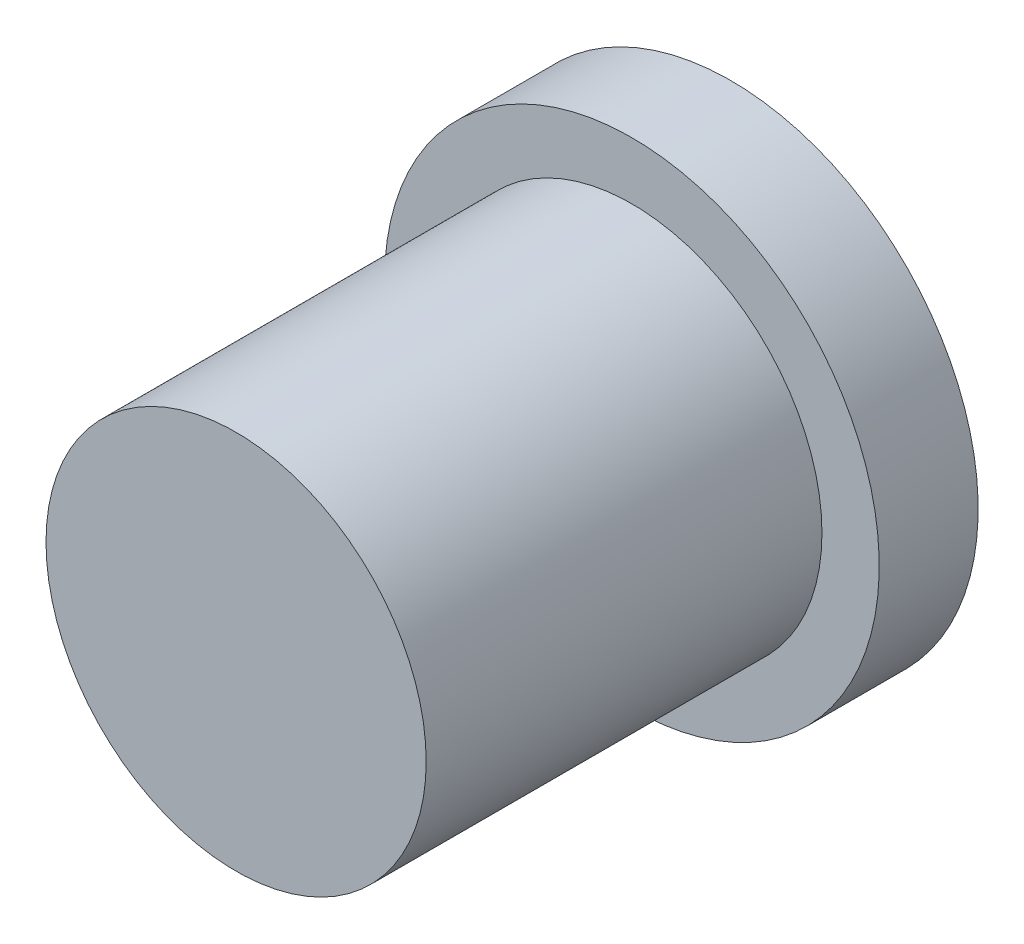
ISO-10303-21;
HEADER;
FILE_DESCRIPTION(('STEP AP214'),'2;1');
FILE_NAME('part.step','',(''),(''),'','','');
FILE_SCHEMA(('AUTOMOTIVE_DESIGN { 1 0 10303 214 1 1 1 1 }'));
ENDSEC;
DATA;
#1=APPLICATION_CONTEXT('core data for automotive mechanical design processes');
#2=APPLICATION_PROTOCOL_DEFINITION('international standard','automotive_design',2000,#1);
#3=PRODUCT_CONTEXT('',#1,'mechanical');
#4=PRODUCT('Part','Part','',(#3));
#5=PRODUCT_RELATED_PRODUCT_CATEGORY('part','',(#4));
#6=PRODUCT_DEFINITION_FORMATION('','',#4);
#7=PRODUCT_DEFINITION_CONTEXT('part definition',#1,'design');
#8=PRODUCT_DEFINITION('design','',#6,#7);
#9=PRODUCT_DEFINITION_SHAPE('','',#8);
#10=(LENGTH_UNIT() NAMED_UNIT(*) SI_UNIT(.MILLI.,.METRE.));
#11=(NAMED_UNIT(*) PLANE_ANGLE_UNIT() SI_UNIT($,.RADIAN.));
#12=(NAMED_UNIT(*) SI_UNIT($,.STERADIAN.) SOLID_ANGLE_UNIT());
#13=UNCERTAINTY_MEASURE_WITH_UNIT(LENGTH_MEASURE(1.E-05),#10,'distance_accuracy_value','');
#14=(GEOMETRIC_REPRESENTATION_CONTEXT(3) GLOBAL_UNCERTAINTY_ASSIGNED_CONTEXT((#13)) GLOBAL_UNIT_ASSIGNED_CONTEXT((#10,
#11,#12)) REPRESENTATION_CONTEXT('',''));
#15=CARTESIAN_POINT('',(0.,0.,0.));
#16=DIRECTION('',(0.,0.,1.));
#17=DIRECTION('',(1.,0.,0.));
#18=AXIS2_PLACEMENT_3D('',#15,#16,#17);
#19=CARTESIAN_POINT('',(0.,0.,12.7));
#20=DIRECTION('',(0.,0.,-1.));
#21=DIRECTION('',(-1.,0.,0.));
#22=AXIS2_PLACEMENT_3D('',#19,#20,#21);
#23=CYLINDRICAL_SURFACE('',#22,6.1);
#24=CARTESIAN_POINT('',(0.,0.,12.7));
#25=DIRECTION('',(0.,0.,1.));
#26=DIRECTION('',(1.,0.,0.));
#27=AXIS2_PLACEMENT_3D('',#24,#25,#26);
#28=CIRCLE('',#27,6.1);
#29=CARTESIAN_POINT('',(6.1,0.,12.7));
#30=VERTEX_POINT('',#29);
#31=EDGE_CURVE('E11',#30,#30,#28,.T.);
#32=ORIENTED_EDGE('',*,*,#31,.F.);
#33=EDGE_LOOP('',(#32));
#34=FACE_BOUND('',#33,.T.);
#35=CARTESIAN_POINT('',(0.,0.,0.));
#36=DIRECTION('',(0.,0.,-1.));
#37=DIRECTION('',(-1.,0.,0.));
#38=AXIS2_PLACEMENT_3D('',#35,#36,#37);
#39=CIRCLE('',#38,6.1);
#40=CARTESIAN_POINT('',(-6.1,0.,0.));
#41=VERTEX_POINT('',#40);
#42=EDGE_CURVE('E40',#41,#41,#39,.F.);
#43=ORIENTED_EDGE('',*,*,#42,.T.);
#44=EDGE_LOOP('',(#43));
#45=FACE_BOUND('',#44,.T.);
#46=ADVANCED_FACE('F37',(#34,#45),#23,.T.);
#47=CARTESIAN_POINT('',(0.,0.,12.7));
#48=DIRECTION('',(0.,0.,1.));
#49=DIRECTION('',(1.,0.,0.));
#50=AXIS2_PLACEMENT_3D('',#47,#48,#49);
#51=PLANE('',#50);
#52=ORIENTED_EDGE('',*,*,#31,.T.);
#53=EDGE_LOOP('',(#52));
#54=FACE_BOUND('',#53,.T.);
#55=ADVANCED_FACE('F64',(#54),#51,.T.);
#56=CARTESIAN_POINT('',(0.,0.,-3.175));
#57=DIRECTION('',(0.,0.,1.));
#58=DIRECTION('',(1.,0.,0.));
#59=AXIS2_PLACEMENT_3D('',#56,#57,#58);
#60=CYLINDRICAL_SURFACE('',#59,7.9375);
#61=CARTESIAN_POINT('',(0.,0.,-3.175));
#62=DIRECTION('',(0.,0.,-1.));
#63=DIRECTION('',(-1.,0.,0.));
#64=AXIS2_PLACEMENT_3D('',#61,#62,#63);
#65=CIRCLE('',#64,7.9375);
#66=CARTESIAN_POINT('',(-7.9375,0.,-3.175));
#67=VERTEX_POINT('',#66);
#68=EDGE_CURVE('E49',#67,#67,#65,.T.);
#69=ORIENTED_EDGE('',*,*,#68,.F.);
#70=EDGE_LOOP('',(#69));
#71=FACE_BOUND('',#70,.T.);
#72=CARTESIAN_POINT('',(0.,0.,0.));
#73=DIRECTION('',(0.,0.,-1.));
#74=DIRECTION('',(-1.,0.,0.));
#75=AXIS2_PLACEMENT_3D('',#72,#73,#74);
#76=CIRCLE('',#75,7.9375);
#77=CARTESIAN_POINT('',(-7.9375,0.,0.));
#78=VERTEX_POINT('',#77);
#79=EDGE_CURVE('E51',#78,#78,#76,.T.);
#80=ORIENTED_EDGE('',*,*,#79,.T.);
#81=EDGE_LOOP('',(#80));
#82=FACE_BOUND('',#81,.T.);
#83=ADVANCED_FACE('F61',(#71,#82),#60,.T.);
#84=CARTESIAN_POINT('',(0.,0.,-3.175));
#85=DIRECTION('',(0.,0.,-1.));
#86=DIRECTION('',(-1.,0.,0.));
#87=AXIS2_PLACEMENT_3D('',#84,#85,#86);
#88=PLANE('',#87);
#89=ORIENTED_EDGE('',*,*,#68,.T.);
#90=EDGE_LOOP('',(#89));
#91=FACE_BOUND('',#90,.T.);
#92=ADVANCED_FACE('F59',(#91),#88,.T.);
#93=CARTESIAN_POINT('',(0.,0.,0.));
#94=DIRECTION('',(0.,0.,-1.));
#95=DIRECTION('',(-1.,0.,0.));
#96=AXIS2_PLACEMENT_3D('',#93,#94,#95);
#97=PLANE('',#96);
#98=ORIENTED_EDGE('',*,*,#42,.F.);
#99=EDGE_LOOP('',(#98));
#100=FACE_BOUND('',#99,.T.);
#101=ORIENTED_EDGE('',*,*,#79,.F.);
#102=EDGE_LOOP('',(#101));
#103=FACE_BOUND('',#102,.T.);
#104=ADVANCED_FACE('F68',(#100,#103),#97,.F.);
#105=CLOSED_SHELL('',(#46,#55,#83,#92,#104));
#106=MANIFOLD_SOLID_BREP('B2',#105);
#107=ADVANCED_BREP_SHAPE_REPRESENTATION('',(#18,#106),#14);
#108=SHAPE_DEFINITION_REPRESENTATION(#9,#107);
ENDSEC;
END-ISO-10303-21;
